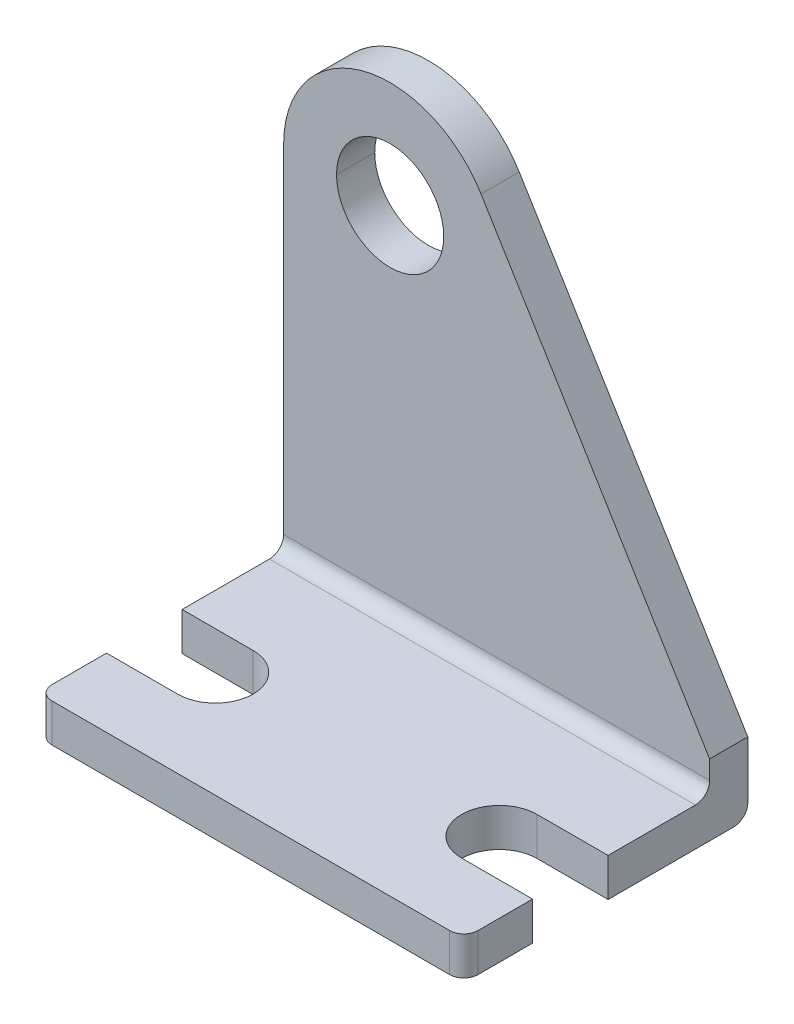
ISO-10303-21;
HEADER;
FILE_DESCRIPTION(('STEP AP214'),'2;1');
FILE_NAME('part.step','',(''),(''),'','','');
FILE_SCHEMA(('AUTOMOTIVE_DESIGN { 1 0 10303 214 1 1 1 1 }'));
ENDSEC;
DATA;
#1=APPLICATION_CONTEXT('core data for automotive mechanical design processes');
#2=APPLICATION_PROTOCOL_DEFINITION('international standard','automotive_design',2000,#1);
#3=PRODUCT_CONTEXT('',#1,'mechanical');
#4=PRODUCT('Part','Part','',(#3));
#5=PRODUCT_RELATED_PRODUCT_CATEGORY('part','',(#4));
#6=PRODUCT_DEFINITION_FORMATION('','',#4);
#7=PRODUCT_DEFINITION_CONTEXT('part definition',#1,'design');
#8=PRODUCT_DEFINITION('design','',#6,#7);
#9=PRODUCT_DEFINITION_SHAPE('','',#8);
#10=(LENGTH_UNIT() NAMED_UNIT(*) SI_UNIT(.MILLI.,.METRE.));
#11=(NAMED_UNIT(*) PLANE_ANGLE_UNIT() SI_UNIT($,.RADIAN.));
#12=(NAMED_UNIT(*) SI_UNIT($,.STERADIAN.) SOLID_ANGLE_UNIT());
#13=UNCERTAINTY_MEASURE_WITH_UNIT(LENGTH_MEASURE(1.E-05),#10,'distance_accuracy_value','');
#14=(GEOMETRIC_REPRESENTATION_CONTEXT(3) GLOBAL_UNCERTAINTY_ASSIGNED_CONTEXT((#13)) GLOBAL_UNIT_ASSIGNED_CONTEXT((#10,
#11,#12)) REPRESENTATION_CONTEXT('',''));
#15=CARTESIAN_POINT('',(0.,0.,0.));
#16=DIRECTION('',(0.,0.,1.));
#17=DIRECTION('',(1.,0.,0.));
#18=AXIS2_PLACEMENT_3D('',#15,#16,#17);
#19=CARTESIAN_POINT('',(36.8300000000003,3.4163,24.1300000000003));
#20=DIRECTION('',(0.,1.,0.));
#21=DIRECTION('',(-0.707106781186554,0.,-0.707106781186541));
#22=AXIS2_PLACEMENT_3D('',#19,#20,#21);
#23=CYLINDRICAL_SURFACE('',#22,1.27);
#24=CARTESIAN_POINT('',(36.8300000000003,0.,24.1300000000003));
#25=DIRECTION('',(0.,1.,0.));
#26=DIRECTION('',(1.,0.,0.));
#27=AXIS2_PLACEMENT_3D('',#24,#25,#26);
#28=CIRCLE('',#27,1.27);
#29=CARTESIAN_POINT('',(36.83,0.,25.4));
#30=VERTEX_POINT('',#29);
#31=CARTESIAN_POINT('',(38.1,0.,24.13));
#32=VERTEX_POINT('',#31);
#33=EDGE_CURVE('E11',#30,#32,#28,.T.);
#34=ORIENTED_EDGE('',*,*,#33,.T.);
#35=DIRECTION('',(0.,-1.,0.));
#36=VECTOR('',#35,1.);
#37=CARTESIAN_POINT('',(38.1,3.4163,24.13));
#38=LINE('',#37,#36);
#39=CARTESIAN_POINT('',(38.1,3.4163,24.13));
#40=VERTEX_POINT('',#39);
#41=EDGE_CURVE('E25',#40,#32,#38,.T.);
#42=ORIENTED_EDGE('',*,*,#41,.F.);
#43=CARTESIAN_POINT('',(36.8300000000003,3.4163,24.1300000000003));
#44=DIRECTION('',(0.,1.,0.));
#45=DIRECTION('',(1.,0.,0.));
#46=AXIS2_PLACEMENT_3D('',#43,#44,#45);
#47=CIRCLE('',#46,1.27);
#48=CARTESIAN_POINT('',(36.8300000000003,3.4163,25.4));
#49=VERTEX_POINT('',#48);
#50=EDGE_CURVE('E429',#49,#40,#47,.T.);
#51=ORIENTED_EDGE('',*,*,#50,.F.);
#52=DIRECTION('',(0.,-1.,0.));
#53=VECTOR('',#52,1.);
#54=CARTESIAN_POINT('',(36.83,3.4163,25.4));
#55=LINE('',#54,#53);
#56=EDGE_CURVE('E425',#49,#30,#55,.T.);
#57=ORIENTED_EDGE('',*,*,#56,.T.);
#58=EDGE_LOOP('',(#34,#42,#51,#57));
#59=FACE_BOUND('',#58,.T.);
#60=ADVANCED_FACE('F17',(#59),#23,.T.);
#61=CARTESIAN_POINT('',(38.1,3.4163,25.4));
#62=DIRECTION('',(0.,0.,-1.));
#63=DIRECTION('',(-1.,0.,0.));
#64=AXIS2_PLACEMENT_3D('',#61,#62,#63);
#65=PLANE('',#64);
#66=DIRECTION('',(0.,-1.,0.));
#67=VECTOR('',#66,1.);
#68=CARTESIAN_POINT('',(1.27000000000001,3.4163,25.4));
#69=LINE('',#68,#67);
#70=CARTESIAN_POINT('',(1.27000000000001,3.4163,25.4));
#71=VERTEX_POINT('',#70);
#72=CARTESIAN_POINT('',(1.26999999999986,0.,25.4));
#73=VERTEX_POINT('',#72);
#74=EDGE_CURVE('E421',#71,#73,#69,.T.);
#75=ORIENTED_EDGE('',*,*,#74,.T.);
#76=DIRECTION('',(-1.,0.,0.));
#77=VECTOR('',#76,1.);
#78=CARTESIAN_POINT('',(38.1,0.,25.4));
#79=LINE('',#78,#77);
#80=EDGE_CURVE('E416',#30,#73,#79,.T.);
#81=ORIENTED_EDGE('',*,*,#80,.F.);
#82=ORIENTED_EDGE('',*,*,#56,.F.);
#83=DIRECTION('',(-1.,0.,0.));
#84=VECTOR('',#83,1.);
#85=CARTESIAN_POINT('',(38.1,3.4163,25.4));
#86=LINE('',#85,#84);
#87=EDGE_CURVE('E412',#49,#71,#86,.T.);
#88=ORIENTED_EDGE('',*,*,#87,.T.);
#89=EDGE_LOOP('',(#75,#81,#82,#88));
#90=FACE_BOUND('',#89,.T.);
#91=ADVANCED_FACE('F447',(#90),#65,.F.);
#92=CARTESIAN_POINT('',(38.1,3.4163,4.6863));
#93=DIRECTION('',(0.,-1.,0.));
#94=DIRECTION('',(0.,0.,-1.));
#95=AXIS2_PLACEMENT_3D('',#92,#93,#94);
#96=PLANE('',#95);
#97=DIRECTION('',(0.,0.,1.));
#98=VECTOR('',#97,1.);
#99=CARTESIAN_POINT('',(0.,3.4163,4.6863));
#100=LINE('',#99,#98);
#101=CARTESIAN_POINT('',(0.,3.4163,19.2532));
#102=VERTEX_POINT('',#101);
#103=CARTESIAN_POINT('',(0.,3.4163,24.13));
#104=VERTEX_POINT('',#103);
#105=EDGE_CURVE('E408',#102,#104,#100,.T.);
#106=ORIENTED_EDGE('',*,*,#105,.T.);
#107=CARTESIAN_POINT('',(1.26999999999984,3.4163,24.1300000000001));
#108=DIRECTION('',(0.,1.,0.));
#109=DIRECTION('',(1.,0.,0.));
#110=AXIS2_PLACEMENT_3D('',#107,#108,#109);
#111=CIRCLE('',#110,1.27);
#112=EDGE_CURVE('E403',#104,#71,#111,.T.);
#113=ORIENTED_EDGE('',*,*,#112,.T.);
#114=ORIENTED_EDGE('',*,*,#87,.F.);
#115=ORIENTED_EDGE('',*,*,#50,.T.);
#116=DIRECTION('',(0.,0.,1.));
#117=VECTOR('',#116,1.);
#118=CARTESIAN_POINT('',(38.1,3.4163,4.6863));
#119=LINE('',#118,#117);
#120=CARTESIAN_POINT('',(38.1,3.4163,19.2532));
#121=VERTEX_POINT('',#120);
#122=EDGE_CURVE('E398',#121,#40,#119,.T.);
#123=ORIENTED_EDGE('',*,*,#122,.F.);
#124=DIRECTION('',(1.,0.,0.));
#125=VECTOR('',#124,1.);
#126=CARTESIAN_POINT('',(31.75,3.4163,19.2532));
#127=LINE('',#126,#125);
#128=CARTESIAN_POINT('',(31.75,3.4163,19.2532));
#129=VERTEX_POINT('',#128);
#130=EDGE_CURVE('E393',#129,#121,#127,.T.);
#131=ORIENTED_EDGE('',*,*,#130,.F.);
#132=CARTESIAN_POINT('',(31.75,3.4163,15.875));
#133=DIRECTION('',(0.,1.,0.));
#134=DIRECTION('',(1.,0.,0.));
#135=AXIS2_PLACEMENT_3D('',#132,#133,#134);
#136=CIRCLE('',#135,3.3782);
#137=CARTESIAN_POINT('',(31.75,3.4163,12.4968));
#138=VERTEX_POINT('',#137);
#139=EDGE_CURVE('E388',#138,#129,#136,.T.);
#140=ORIENTED_EDGE('',*,*,#139,.F.);
#141=DIRECTION('',(-1.,0.,0.));
#142=VECTOR('',#141,1.);
#143=CARTESIAN_POINT('',(38.1,3.4163,12.4968));
#144=LINE('',#143,#142);
#145=CARTESIAN_POINT('',(38.1,3.4163,12.4968));
#146=VERTEX_POINT('',#145);
#147=EDGE_CURVE('E383',#146,#138,#144,.T.);
#148=ORIENTED_EDGE('',*,*,#147,.F.);
#149=DIRECTION('',(0.,0.,1.));
#150=VECTOR('',#149,1.);
#151=CARTESIAN_POINT('',(38.1,3.4163,4.6863));
#152=LINE('',#151,#150);
#153=CARTESIAN_POINT('',(38.1,3.4163,4.6863));
#154=VERTEX_POINT('',#153);
#155=EDGE_CURVE('E378',#154,#146,#152,.T.);
#156=ORIENTED_EDGE('',*,*,#155,.F.);
#157=DIRECTION('',(-1.,0.,0.));
#158=VECTOR('',#157,1.);
#159=CARTESIAN_POINT('',(38.1,3.4163,4.6863));
#160=LINE('',#159,#158);
#161=CARTESIAN_POINT('',(0.,3.4163,4.6863));
#162=VERTEX_POINT('',#161);
#163=EDGE_CURVE('E374',#154,#162,#160,.T.);
#164=ORIENTED_EDGE('',*,*,#163,.T.);
#165=DIRECTION('',(0.,0.,1.));
#166=VECTOR('',#165,1.);
#167=CARTESIAN_POINT('',(0.,3.4163,4.6863));
#168=LINE('',#167,#166);
#169=CARTESIAN_POINT('',(0.,3.4163,12.4968));
#170=VERTEX_POINT('',#169);
#171=EDGE_CURVE('E370',#162,#170,#168,.T.);
#172=ORIENTED_EDGE('',*,*,#171,.T.);
#173=DIRECTION('',(-1.,0.,0.));
#174=VECTOR('',#173,1.);
#175=CARTESIAN_POINT('',(6.35,3.4163,12.4968));
#176=LINE('',#175,#174);
#177=CARTESIAN_POINT('',(6.35,3.4163,12.4968));
#178=VERTEX_POINT('',#177);
#179=EDGE_CURVE('E365',#178,#170,#176,.T.);
#180=ORIENTED_EDGE('',*,*,#179,.F.);
#181=CARTESIAN_POINT('',(6.35,3.4163,15.875));
#182=DIRECTION('',(0.,1.,0.));
#183=DIRECTION('',(1.,0.,0.));
#184=AXIS2_PLACEMENT_3D('',#181,#182,#183);
#185=CIRCLE('',#184,3.3782);
#186=CARTESIAN_POINT('',(6.35,3.4163,19.2532));
#187=VERTEX_POINT('',#186);
#188=EDGE_CURVE('E360',#187,#178,#185,.T.);
#189=ORIENTED_EDGE('',*,*,#188,.F.);
#190=DIRECTION('',(1.,0.,0.));
#191=VECTOR('',#190,1.);
#192=CARTESIAN_POINT('',(0.,3.4163,19.2532));
#193=LINE('',#192,#191);
#194=EDGE_CURVE('E355',#102,#187,#193,.T.);
#195=ORIENTED_EDGE('',*,*,#194,.F.);
#196=EDGE_LOOP('',(#106,#113,#114,#115,#123,#131,#140,#148,#156,#164,#172,#180,#189,#195));
#197=FACE_BOUND('',#196,.T.);
#198=ADVANCED_FACE('F441',(#197),#96,.F.);
#199=CARTESIAN_POINT('',(0.,3.4163,19.2532));
#200=DIRECTION('',(0.,0.,-1.));
#201=DIRECTION('',(-1.,0.,0.));
#202=AXIS2_PLACEMENT_3D('',#199,#200,#201);
#203=PLANE('',#202);
#204=DIRECTION('',(1.,0.,0.));
#205=VECTOR('',#204,1.);
#206=CARTESIAN_POINT('',(0.,0.,19.2532));
#207=LINE('',#206,#205);
#208=CARTESIAN_POINT('',(0.,0.,19.2532));
#209=VERTEX_POINT('',#208);
#210=CARTESIAN_POINT('',(6.35,0.,19.2532));
#211=VERTEX_POINT('',#210);
#212=EDGE_CURVE('E350',#209,#211,#207,.T.);
#213=ORIENTED_EDGE('',*,*,#212,.F.);
#214=DIRECTION('',(0.,-1.,0.));
#215=VECTOR('',#214,1.);
#216=CARTESIAN_POINT('',(0.,3.4163,19.2532));
#217=LINE('',#216,#215);
#218=EDGE_CURVE('E345',#102,#209,#217,.T.);
#219=ORIENTED_EDGE('',*,*,#218,.F.);
#220=ORIENTED_EDGE('',*,*,#194,.T.);
#221=DIRECTION('',(0.,-1.,0.));
#222=VECTOR('',#221,1.);
#223=CARTESIAN_POINT('',(6.35,3.4163,19.2532));
#224=LINE('',#223,#222);
#225=EDGE_CURVE('E341',#187,#211,#224,.T.);
#226=ORIENTED_EDGE('',*,*,#225,.T.);
#227=EDGE_LOOP('',(#213,#219,#220,#226));
#228=FACE_BOUND('',#227,.T.);
#229=ADVANCED_FACE('F488',(#228),#203,.T.);
#230=CARTESIAN_POINT('',(6.35,3.4163,15.875));
#231=DIRECTION('',(0.,1.,0.));
#232=DIRECTION('',(-1.,0.,0.));
#233=AXIS2_PLACEMENT_3D('',#230,#231,#232);
#234=CYLINDRICAL_SURFACE('',#233,3.3782);
#235=DIRECTION('',(0.,-1.,0.));
#236=VECTOR('',#235,1.);
#237=CARTESIAN_POINT('',(6.35,3.4163,12.4968));
#238=LINE('',#237,#236);
#239=CARTESIAN_POINT('',(6.35,0.,12.4968));
#240=VERTEX_POINT('',#239);
#241=EDGE_CURVE('E337',#178,#240,#238,.T.);
#242=ORIENTED_EDGE('',*,*,#241,.T.);
#243=CARTESIAN_POINT('',(6.35,0.,15.875));
#244=DIRECTION('',(0.,1.,0.));
#245=DIRECTION('',(1.,0.,0.));
#246=AXIS2_PLACEMENT_3D('',#243,#244,#245);
#247=CIRCLE('',#246,3.3782);
#248=EDGE_CURVE('E332',#211,#240,#247,.T.);
#249=ORIENTED_EDGE('',*,*,#248,.F.);
#250=ORIENTED_EDGE('',*,*,#225,.F.);
#251=ORIENTED_EDGE('',*,*,#188,.T.);
#252=EDGE_LOOP('',(#242,#249,#250,#251));
#253=FACE_BOUND('',#252,.T.);
#254=ADVANCED_FACE('F483',(#253),#234,.F.);
#255=CARTESIAN_POINT('',(38.1,0.,25.4));
#256=DIRECTION('',(0.,1.,0.));
#257=DIRECTION('',(0.,0.,1.));
#258=AXIS2_PLACEMENT_3D('',#255,#256,#257);
#259=PLANE('',#258);
#260=ORIENTED_EDGE('',*,*,#80,.T.);
#261=CARTESIAN_POINT('',(1.26999999999984,0.,24.1300000000001));
#262=DIRECTION('',(0.,1.,0.));
#263=DIRECTION('',(1.,0.,0.));
#264=AXIS2_PLACEMENT_3D('',#261,#262,#263);
#265=CIRCLE('',#264,1.27);
#266=CARTESIAN_POINT('',(0.,0.,24.13));
#267=VERTEX_POINT('',#266);
#268=EDGE_CURVE('E327',#267,#73,#265,.T.);
#269=ORIENTED_EDGE('',*,*,#268,.F.);
#270=DIRECTION('',(0.,0.,-1.));
#271=VECTOR('',#270,1.);
#272=CARTESIAN_POINT('',(0.,0.,25.4));
#273=LINE('',#272,#271);
#274=EDGE_CURVE('E322',#267,#209,#273,.T.);
#275=ORIENTED_EDGE('',*,*,#274,.T.);
#276=ORIENTED_EDGE('',*,*,#212,.T.);
#277=ORIENTED_EDGE('',*,*,#248,.T.);
#278=DIRECTION('',(-1.,0.,0.));
#279=VECTOR('',#278,1.);
#280=CARTESIAN_POINT('',(6.35,0.,12.4968));
#281=LINE('',#280,#279);
#282=CARTESIAN_POINT('',(0.,0.,12.4968));
#283=VERTEX_POINT('',#282);
#284=EDGE_CURVE('E318',#240,#283,#281,.T.);
#285=ORIENTED_EDGE('',*,*,#284,.T.);
#286=DIRECTION('',(0.,0.,-1.));
#287=VECTOR('',#286,1.);
#288=CARTESIAN_POINT('',(0.,0.,25.4));
#289=LINE('',#288,#287);
#290=CARTESIAN_POINT('',(0.,0.,1.27));
#291=VERTEX_POINT('',#290);
#292=EDGE_CURVE('E314',#283,#291,#289,.T.);
#293=ORIENTED_EDGE('',*,*,#292,.T.);
#294=DIRECTION('',(-1.,0.,0.));
#295=VECTOR('',#294,1.);
#296=CARTESIAN_POINT('',(38.1,0.,1.27));
#297=LINE('',#296,#295);
#298=CARTESIAN_POINT('',(38.1,0.,1.27));
#299=VERTEX_POINT('',#298);
#300=EDGE_CURVE('E309',#299,#291,#297,.T.);
#301=ORIENTED_EDGE('',*,*,#300,.F.);
#302=DIRECTION('',(0.,0.,-1.));
#303=VECTOR('',#302,1.);
#304=CARTESIAN_POINT('',(38.1,0.,25.4));
#305=LINE('',#304,#303);
#306=CARTESIAN_POINT('',(38.1,0.,12.4968));
#307=VERTEX_POINT('',#306);
#308=EDGE_CURVE('E304',#307,#299,#305,.T.);
#309=ORIENTED_EDGE('',*,*,#308,.F.);
#310=DIRECTION('',(-1.,0.,0.));
#311=VECTOR('',#310,1.);
#312=CARTESIAN_POINT('',(38.1,0.,12.4968));
#313=LINE('',#312,#311);
#314=CARTESIAN_POINT('',(31.75,0.,12.4968));
#315=VERTEX_POINT('',#314);
#316=EDGE_CURVE('E300',#307,#315,#313,.T.);
#317=ORIENTED_EDGE('',*,*,#316,.T.);
#318=CARTESIAN_POINT('',(31.75,0.,15.875));
#319=DIRECTION('',(0.,1.,0.));
#320=DIRECTION('',(1.,0.,0.));
#321=AXIS2_PLACEMENT_3D('',#318,#319,#320);
#322=CIRCLE('',#321,3.3782);
#323=CARTESIAN_POINT('',(31.75,0.,19.2532));
#324=VERTEX_POINT('',#323);
#325=EDGE_CURVE('E296',#315,#324,#322,.T.);
#326=ORIENTED_EDGE('',*,*,#325,.T.);
#327=DIRECTION('',(1.,0.,0.));
#328=VECTOR('',#327,1.);
#329=CARTESIAN_POINT('',(31.75,0.,19.2532));
#330=LINE('',#329,#328);
#331=CARTESIAN_POINT('',(38.1,0.,19.2532));
#332=VERTEX_POINT('',#331);
#333=EDGE_CURVE('E292',#324,#332,#330,.T.);
#334=ORIENTED_EDGE('',*,*,#333,.T.);
#335=DIRECTION('',(0.,0.,-1.));
#336=VECTOR('',#335,1.);
#337=CARTESIAN_POINT('',(38.1,0.,25.4));
#338=LINE('',#337,#336);
#339=EDGE_CURVE('E287',#32,#332,#338,.T.);
#340=ORIENTED_EDGE('',*,*,#339,.F.);
#341=ORIENTED_EDGE('',*,*,#33,.F.);
#342=EDGE_LOOP('',(#260,#269,#275,#276,#277,#285,#293,#301,#309,#317,#326,#334,#340,#341));
#343=FACE_BOUND('',#342,.T.);
#344=ADVANCED_FACE('F450',(#343),#259,.F.);
#345=CARTESIAN_POINT('',(38.1,1.26999999999998,1.26999999999998));
#346=DIRECTION('',(1.,0.,0.));
#347=DIRECTION('',(0.,0.,-1.));
#348=AXIS2_PLACEMENT_3D('',#345,#346,#347);
#349=PLANE('',#348);
#350=ORIENTED_EDGE('',*,*,#41,.T.);
#351=ORIENTED_EDGE('',*,*,#339,.T.);
#352=DIRECTION('',(0.,-1.,0.));
#353=VECTOR('',#352,1.);
#354=CARTESIAN_POINT('',(38.1,3.4163,19.2532));
#355=LINE('',#354,#353);
#356=EDGE_CURVE('E282',#121,#332,#355,.T.);
#357=ORIENTED_EDGE('',*,*,#356,.F.);
#358=ORIENTED_EDGE('',*,*,#122,.T.);
#359=EDGE_LOOP('',(#350,#351,#357,#358));
#360=FACE_BOUND('',#359,.T.);
#361=ADVANCED_FACE('F438',(#360),#349,.T.);
#362=CARTESIAN_POINT('',(31.75,3.4163,19.2532));
#363=DIRECTION('',(0.,0.,-1.));
#364=DIRECTION('',(-1.,0.,0.));
#365=AXIS2_PLACEMENT_3D('',#362,#363,#364);
#366=PLANE('',#365);
#367=ORIENTED_EDGE('',*,*,#333,.F.);
#368=DIRECTION('',(0.,-1.,0.));
#369=VECTOR('',#368,1.);
#370=CARTESIAN_POINT('',(31.75,3.4163,19.2532));
#371=LINE('',#370,#369);
#372=EDGE_CURVE('E277',#129,#324,#371,.T.);
#373=ORIENTED_EDGE('',*,*,#372,.F.);
#374=ORIENTED_EDGE('',*,*,#130,.T.);
#375=ORIENTED_EDGE('',*,*,#356,.T.);
#376=EDGE_LOOP('',(#367,#373,#374,#375));
#377=FACE_BOUND('',#376,.T.);
#378=ADVANCED_FACE('F454',(#377),#366,.T.);
#379=CARTESIAN_POINT('',(31.75,3.4163,15.875));
#380=DIRECTION('',(0.,1.,0.));
#381=DIRECTION('',(1.,0.,0.));
#382=AXIS2_PLACEMENT_3D('',#379,#380,#381);
#383=CYLINDRICAL_SURFACE('',#382,3.3782);
#384=DIRECTION('',(0.,-1.,0.));
#385=VECTOR('',#384,1.);
#386=CARTESIAN_POINT('',(31.75,3.4163,12.4968));
#387=LINE('',#386,#385);
#388=EDGE_CURVE('E272',#138,#315,#387,.T.);
#389=ORIENTED_EDGE('',*,*,#388,.F.);
#390=ORIENTED_EDGE('',*,*,#139,.T.);
#391=ORIENTED_EDGE('',*,*,#372,.T.);
#392=ORIENTED_EDGE('',*,*,#325,.F.);
#393=EDGE_LOOP('',(#389,#390,#391,#392));
#394=FACE_BOUND('',#393,.T.);
#395=ADVANCED_FACE('F457',(#394),#383,.F.);
#396=CARTESIAN_POINT('',(38.1,3.4163,12.4968));
#397=DIRECTION('',(0.,0.,1.));
#398=DIRECTION('',(1.,0.,0.));
#399=AXIS2_PLACEMENT_3D('',#396,#397,#398);
#400=PLANE('',#399);
#401=ORIENTED_EDGE('',*,*,#316,.F.);
#402=DIRECTION('',(0.,-1.,0.));
#403=VECTOR('',#402,1.);
#404=CARTESIAN_POINT('',(38.1,3.4163,12.4968));
#405=LINE('',#404,#403);
#406=EDGE_CURVE('E267',#146,#307,#405,.T.);
#407=ORIENTED_EDGE('',*,*,#406,.F.);
#408=ORIENTED_EDGE('',*,*,#147,.T.);
#409=ORIENTED_EDGE('',*,*,#388,.T.);
#410=EDGE_LOOP('',(#401,#407,#408,#409));
#411=FACE_BOUND('',#410,.T.);
#412=ADVANCED_FACE('F462',(#411),#400,.T.);
#413=CARTESIAN_POINT('',(38.1,1.26999999999998,1.26999999999998));
#414=DIRECTION('',(1.,0.,0.));
#415=DIRECTION('',(0.,0.,-1.));
#416=AXIS2_PLACEMENT_3D('',#413,#414,#415);
#417=PLANE('',#416);
#418=ORIENTED_EDGE('',*,*,#155,.T.);
#419=ORIENTED_EDGE('',*,*,#406,.T.);
#420=ORIENTED_EDGE('',*,*,#308,.T.);
#421=CARTESIAN_POINT('',(38.1,1.26999999999998,1.26999999999998));
#422=DIRECTION('',(1.,0.,0.));
#423=DIRECTION('',(0.,0.,-1.));
#424=AXIS2_PLACEMENT_3D('',#421,#422,#423);
#425=CIRCLE('',#424,1.27);
#426=CARTESIAN_POINT('',(38.1,1.27,0.));
#427=VERTEX_POINT('',#426);
#428=EDGE_CURVE('E263',#299,#427,#425,.T.);
#429=ORIENTED_EDGE('',*,*,#428,.T.);
#430=DIRECTION('',(0.,1.,0.));
#431=VECTOR('',#430,1.);
#432=CARTESIAN_POINT('',(38.1,1.27,0.));
#433=LINE('',#432,#431);
#434=CARTESIAN_POINT('',(38.1,6.35,0.));
#435=VERTEX_POINT('',#434);
#436=EDGE_CURVE('E259',#427,#435,#433,.T.);
#437=ORIENTED_EDGE('',*,*,#436,.T.);
#438=DIRECTION('',(0.,0.,-1.));
#439=VECTOR('',#438,1.);
#440=CARTESIAN_POINT('',(38.1,6.35,1.26999999999998));
#441=LINE('',#440,#439);
#442=CARTESIAN_POINT('',(38.1,6.35,3.4163));
#443=VERTEX_POINT('',#442);
#444=EDGE_CURVE('E254',#443,#435,#441,.T.);
#445=ORIENTED_EDGE('',*,*,#444,.F.);
#446=DIRECTION('',(0.,-1.,0.));
#447=VECTOR('',#446,1.);
#448=CARTESIAN_POINT('',(38.1,44.45,3.4163));
#449=LINE('',#448,#447);
#450=CARTESIAN_POINT('',(38.1,4.6863,3.4163));
#451=VERTEX_POINT('',#450);
#452=EDGE_CURVE('E250',#443,#451,#449,.T.);
#453=ORIENTED_EDGE('',*,*,#452,.T.);
#454=CARTESIAN_POINT('',(38.1,4.68630000000005,4.68630000000005));
#455=DIRECTION('',(1.,0.,0.));
#456=DIRECTION('',(0.,0.,-1.));
#457=AXIS2_PLACEMENT_3D('',#454,#455,#456);
#458=CIRCLE('',#457,1.27);
#459=EDGE_CURVE('E245',#154,#451,#458,.T.);
#460=ORIENTED_EDGE('',*,*,#459,.F.);
#461=EDGE_LOOP('',(#418,#419,#420,#429,#437,#445,#453,#460));
#462=FACE_BOUND('',#461,.T.);
#463=ADVANCED_FACE('F464',(#462),#417,.T.);
#464=CARTESIAN_POINT('',(38.1,4.68630000000005,4.68630000000005));
#465=DIRECTION('',(1.,0.,0.));
#466=DIRECTION('',(0.,0.707106781186533,0.707106781186562));
#467=AXIS2_PLACEMENT_3D('',#464,#465,#466);
#468=CYLINDRICAL_SURFACE('',#467,1.27);
#469=DIRECTION('',(-1.,0.,0.));
#470=VECTOR('',#469,1.);
#471=CARTESIAN_POINT('',(38.1,4.6863,3.4163));
#472=LINE('',#471,#470);
#473=CARTESIAN_POINT('',(0.,4.6863,3.4163));
#474=VERTEX_POINT('',#473);
#475=EDGE_CURVE('E241',#451,#474,#472,.T.);
#476=ORIENTED_EDGE('',*,*,#475,.T.);
#477=CARTESIAN_POINT('',(0.,4.68630000000005,4.68630000000005));
#478=DIRECTION('',(1.,0.,0.));
#479=DIRECTION('',(0.,0.,-1.));
#480=AXIS2_PLACEMENT_3D('',#477,#478,#479);
#481=CIRCLE('',#480,1.27);
#482=EDGE_CURVE('E236',#162,#474,#481,.T.);
#483=ORIENTED_EDGE('',*,*,#482,.F.);
#484=ORIENTED_EDGE('',*,*,#163,.F.);
#485=ORIENTED_EDGE('',*,*,#459,.T.);
#486=EDGE_LOOP('',(#476,#483,#484,#485));
#487=FACE_BOUND('',#486,.T.);
#488=ADVANCED_FACE('F470',(#487),#468,.F.);
#489=CARTESIAN_POINT('',(0.,1.26999999999998,1.26999999999998));
#490=DIRECTION('',(1.,0.,0.));
#491=DIRECTION('',(0.,0.,-1.));
#492=AXIS2_PLACEMENT_3D('',#489,#490,#491);
#493=PLANE('',#492);
#494=DIRECTION('',(0.,-1.,0.));
#495=VECTOR('',#494,1.);
#496=CARTESIAN_POINT('',(0.,3.4163,12.4968));
#497=LINE('',#496,#495);
#498=EDGE_CURVE('E231',#170,#283,#497,.T.);
#499=ORIENTED_EDGE('',*,*,#498,.F.);
#500=ORIENTED_EDGE('',*,*,#171,.F.);
#501=ORIENTED_EDGE('',*,*,#482,.T.);
#502=DIRECTION('',(0.,-1.,0.));
#503=VECTOR('',#502,1.);
#504=CARTESIAN_POINT('',(0.,44.45,3.4163));
#505=LINE('',#504,#503);
#506=CARTESIAN_POINT('',(0.,34.925,3.4163));
#507=VERTEX_POINT('',#506);
#508=EDGE_CURVE('E226',#507,#474,#505,.T.);
#509=ORIENTED_EDGE('',*,*,#508,.F.);
#510=DIRECTION('',(0.,0.,-1.));
#511=VECTOR('',#510,1.);
#512=CARTESIAN_POINT('',(0.,34.9250000000003,25.4));
#513=LINE('',#512,#511);
#514=CARTESIAN_POINT('',(0.,34.9250000000003,0.));
#515=VERTEX_POINT('',#514);
#516=EDGE_CURVE('E222',#507,#515,#513,.T.);
#517=ORIENTED_EDGE('',*,*,#516,.T.);
#518=DIRECTION('',(0.,1.,0.));
#519=VECTOR('',#518,1.);
#520=CARTESIAN_POINT('',(0.,1.27,0.));
#521=LINE('',#520,#519);
#522=CARTESIAN_POINT('',(0.,1.27,0.));
#523=VERTEX_POINT('',#522);
#524=EDGE_CURVE('E217',#523,#515,#521,.T.);
#525=ORIENTED_EDGE('',*,*,#524,.F.);
#526=CARTESIAN_POINT('',(0.,1.26999999999998,1.26999999999998));
#527=DIRECTION('',(1.,0.,0.));
#528=DIRECTION('',(0.,0.,-1.));
#529=AXIS2_PLACEMENT_3D('',#526,#527,#528);
#530=CIRCLE('',#529,1.27);
#531=EDGE_CURVE('E212',#291,#523,#530,.T.);
#532=ORIENTED_EDGE('',*,*,#531,.F.);
#533=ORIENTED_EDGE('',*,*,#292,.F.);
#534=EDGE_LOOP('',(#499,#500,#501,#509,#517,#525,#532,#533));
#535=FACE_BOUND('',#534,.T.);
#536=ADVANCED_FACE('F475',(#535),#493,.F.);
#537=CARTESIAN_POINT('',(38.1,1.26999999999998,1.26999999999998));
#538=DIRECTION('',(1.,0.,0.));
#539=DIRECTION('',(0.,0.707106781186548,0.707106781186547));
#540=AXIS2_PLACEMENT_3D('',#537,#538,#539);
#541=CYLINDRICAL_SURFACE('',#540,1.27);
#542=ORIENTED_EDGE('',*,*,#531,.T.);
#543=DIRECTION('',(-1.,0.,0.));
#544=VECTOR('',#543,1.);
#545=CARTESIAN_POINT('',(38.1,1.27,0.));
#546=LINE('',#545,#544);
#547=EDGE_CURVE('E207',#427,#523,#546,.T.);
#548=ORIENTED_EDGE('',*,*,#547,.F.);
#549=ORIENTED_EDGE('',*,*,#428,.F.);
#550=ORIENTED_EDGE('',*,*,#300,.T.);
#551=EDGE_LOOP('',(#542,#548,#549,#550));
#552=FACE_BOUND('',#551,.T.);
#553=ADVANCED_FACE('F535',(#552),#541,.T.);
#554=CARTESIAN_POINT('',(38.1,1.27,0.));
#555=DIRECTION('',(0.,0.,1.));
#556=DIRECTION('',(1.,0.,0.));
#557=AXIS2_PLACEMENT_3D('',#554,#555,#556);
#558=PLANE('',#557);
#559=CARTESIAN_POINT('',(9.525,34.925,0.));
#560=DIRECTION('',(0.,0.,1.));
#561=DIRECTION('',(1.,0.,0.));
#562=AXIS2_PLACEMENT_3D('',#559,#560,#561);
#563=CIRCLE('',#562,4.79425);
#564=CARTESIAN_POINT('',(14.31925,34.925,0.));
#565=VERTEX_POINT('',#564);
#566=CARTESIAN_POINT('',(4.73075,34.925,0.));
#567=VERTEX_POINT('',#566);
#568=EDGE_CURVE('E203',#565,#567,#563,.T.);
#569=ORIENTED_EDGE('',*,*,#568,.T.);
#570=CARTESIAN_POINT('',(9.525,34.925,0.));
#571=DIRECTION('',(0.,0.,1.));
#572=DIRECTION('',(1.,0.,0.));
#573=AXIS2_PLACEMENT_3D('',#570,#571,#572);
#574=CIRCLE('',#573,4.79425);
#575=EDGE_CURVE('E170',#567,#565,#574,.T.);
#576=ORIENTED_EDGE('',*,*,#575,.T.);
#577=EDGE_LOOP('',(#569,#576));
#578=FACE_BOUND('',#577,.T.);
#579=ORIENTED_EDGE('',*,*,#524,.T.);
#580=CARTESIAN_POINT('',(9.52499999999992,34.9250000000003,0.));
#581=DIRECTION('',(0.,0.,1.));
#582=DIRECTION('',(1.,0.,0.));
#583=AXIS2_PLACEMENT_3D('',#580,#581,#582);
#584=CIRCLE('',#583,9.525);
#585=CARTESIAN_POINT('',(17.657930180668,39.8829301806679,0.));
#586=VERTEX_POINT('',#585);
#587=EDGE_CURVE('E195',#586,#515,#584,.T.);
#588=ORIENTED_EDGE('',*,*,#587,.F.);
#589=DIRECTION('',(-0.520517604269611,0.853850937602943,0.));
#590=VECTOR('',#589,1.);
#591=CARTESIAN_POINT('',(38.1,6.35,0.));
#592=LINE('',#591,#590);
#593=EDGE_CURVE('E190',#435,#586,#592,.T.);
#594=ORIENTED_EDGE('',*,*,#593,.F.);
#595=ORIENTED_EDGE('',*,*,#436,.F.);
#596=ORIENTED_EDGE('',*,*,#547,.T.);
#597=EDGE_LOOP('',(#579,#588,#594,#595,#596));
#598=FACE_BOUND('',#597,.T.);
#599=ADVANCED_FACE('F538',(#578,#598),#558,.F.);
#600=CARTESIAN_POINT('',(38.1,6.35,25.4));
#601=DIRECTION('',(-0.853850937602943,-0.520517604269611,0.));
#602=DIRECTION('',(0.520517604269611,-0.853850937602943,0.));
#603=AXIS2_PLACEMENT_3D('',#600,#601,#602);
#604=PLANE('',#603);
#605=ORIENTED_EDGE('',*,*,#444,.T.);
#606=ORIENTED_EDGE('',*,*,#593,.T.);
#607=DIRECTION('',(0.,0.,-1.));
#608=VECTOR('',#607,1.);
#609=CARTESIAN_POINT('',(17.657930180668,39.8829301806679,25.4));
#610=LINE('',#609,#608);
#611=CARTESIAN_POINT('',(17.657930180668,39.8829301806679,3.4163));
#612=VERTEX_POINT('',#611);
#613=EDGE_CURVE('E179',#612,#586,#610,.T.);
#614=ORIENTED_EDGE('',*,*,#613,.F.);
#615=DIRECTION('',(-0.520517604269611,0.853850937602943,0.));
#616=VECTOR('',#615,1.);
#617=CARTESIAN_POINT('',(21.1666666666666,34.1272402408907,3.4163));
#618=LINE('',#617,#616);
#619=EDGE_CURVE('E176',#443,#612,#618,.T.);
#620=ORIENTED_EDGE('',*,*,#619,.F.);
#621=EDGE_LOOP('',(#605,#606,#614,#620));
#622=FACE_BOUND('',#621,.T.);
#623=ADVANCED_FACE('F542',(#622),#604,.F.);
#624=CARTESIAN_POINT('',(38.1,44.45,3.4163));
#625=DIRECTION('',(0.,0.,-1.));
#626=DIRECTION('',(-1.,0.,0.));
#627=AXIS2_PLACEMENT_3D('',#624,#625,#626);
#628=PLANE('',#627);
#629=CARTESIAN_POINT('',(9.525,34.925,3.4163));
#630=DIRECTION('',(0.,0.,1.));
#631=DIRECTION('',(1.,0.,0.));
#632=AXIS2_PLACEMENT_3D('',#629,#630,#631);
#633=CIRCLE('',#632,4.79425);
#634=CARTESIAN_POINT('',(14.31925,34.925,3.4163));
#635=VERTEX_POINT('',#634);
#636=CARTESIAN_POINT('',(4.73075,34.925,3.4163));
#637=VERTEX_POINT('',#636);
#638=EDGE_CURVE('E160',#635,#637,#633,.T.);
#639=ORIENTED_EDGE('',*,*,#638,.F.);
#640=CARTESIAN_POINT('',(9.525,34.925,3.4163));
#641=DIRECTION('',(0.,0.,1.));
#642=DIRECTION('',(1.,0.,0.));
#643=AXIS2_PLACEMENT_3D('',#640,#641,#642);
#644=CIRCLE('',#643,4.79425);
#645=EDGE_CURVE('E155',#637,#635,#644,.T.);
#646=ORIENTED_EDGE('',*,*,#645,.F.);
#647=EDGE_LOOP('',(#639,#646));
#648=FACE_BOUND('',#647,.T.);
#649=ORIENTED_EDGE('',*,*,#619,.T.);
#650=CARTESIAN_POINT('',(9.52499999999992,34.9250000000003,3.4163));
#651=DIRECTION('',(0.,0.,-1.));
#652=DIRECTION('',(-1.,0.,0.));
#653=AXIS2_PLACEMENT_3D('',#650,#651,#652);
#654=CIRCLE('',#653,9.525);
#655=EDGE_CURVE('E164',#507,#612,#654,.T.);
#656=ORIENTED_EDGE('',*,*,#655,.F.);
#657=ORIENTED_EDGE('',*,*,#508,.T.);
#658=ORIENTED_EDGE('',*,*,#475,.F.);
#659=ORIENTED_EDGE('',*,*,#452,.F.);
#660=EDGE_LOOP('',(#649,#656,#657,#658,#659));
#661=FACE_BOUND('',#660,.T.);
#662=ADVANCED_FACE('F157',(#648,#661),#628,.F.);
#663=CARTESIAN_POINT('',(9.52499999999992,34.9250000000003,25.4));
#664=DIRECTION('',(0.,0.,1.));
#665=DIRECTION('',(0.270323012706132,-0.962769686270543,0.));
#666=AXIS2_PLACEMENT_3D('',#663,#664,#665);
#667=CYLINDRICAL_SURFACE('',#666,9.525);
#668=ORIENTED_EDGE('',*,*,#587,.T.);
#669=ORIENTED_EDGE('',*,*,#516,.F.);
#670=ORIENTED_EDGE('',*,*,#655,.T.);
#671=ORIENTED_EDGE('',*,*,#613,.T.);
#672=EDGE_LOOP('',(#668,#669,#670,#671));
#673=FACE_BOUND('',#672,.T.);
#674=ADVANCED_FACE('F549',(#673),#667,.T.);
#675=CARTESIAN_POINT('',(9.525,34.925,3.4163));
#676=DIRECTION('',(0.,0.,1.));
#677=DIRECTION('',(0.,1.,0.));
#678=AXIS2_PLACEMENT_3D('',#675,#676,#677);
#679=CYLINDRICAL_SURFACE('',#678,4.79425);
#680=ORIENTED_EDGE('',*,*,#575,.F.);
#681=DIRECTION('',(0.,0.,1.));
#682=VECTOR('',#681,1.);
#683=CARTESIAN_POINT('',(4.73075,34.925,0.));
#684=LINE('',#683,#682);
#685=EDGE_CURVE('E168',#567,#637,#684,.T.);
#686=ORIENTED_EDGE('',*,*,#685,.T.);
#687=ORIENTED_EDGE('',*,*,#645,.T.);
#688=DIRECTION('',(0.,0.,1.));
#689=VECTOR('',#688,1.);
#690=CARTESIAN_POINT('',(14.31925,34.925,0.));
#691=LINE('',#690,#689);
#692=EDGE_CURVE('E173',#565,#635,#691,.T.);
#693=ORIENTED_EDGE('',*,*,#692,.F.);
#694=EDGE_LOOP('',(#680,#686,#687,#693));
#695=FACE_BOUND('',#694,.T.);
#696=ADVANCED_FACE('F169',(#695),#679,.F.);
#697=CARTESIAN_POINT('',(9.525,34.925,3.4163));
#698=DIRECTION('',(0.,0.,1.));
#699=DIRECTION('',(0.,-1.,0.));
#700=AXIS2_PLACEMENT_3D('',#697,#698,#699);
#701=CYLINDRICAL_SURFACE('',#700,4.79425);
#702=ORIENTED_EDGE('',*,*,#638,.T.);
#703=ORIENTED_EDGE('',*,*,#685,.F.);
#704=ORIENTED_EDGE('',*,*,#568,.F.);
#705=ORIENTED_EDGE('',*,*,#692,.T.);
#706=EDGE_LOOP('',(#702,#703,#704,#705));
#707=FACE_BOUND('',#706,.T.);
#708=ADVANCED_FACE('F175',(#707),#701,.F.);
#709=CARTESIAN_POINT('',(6.35,3.4163,12.4968));
#710=DIRECTION('',(0.,0.,1.));
#711=DIRECTION('',(1.,0.,0.));
#712=AXIS2_PLACEMENT_3D('',#709,#710,#711);
#713=PLANE('',#712);
#714=ORIENTED_EDGE('',*,*,#284,.F.);
#715=ORIENTED_EDGE('',*,*,#241,.F.);
#716=ORIENTED_EDGE('',*,*,#179,.T.);
#717=ORIENTED_EDGE('',*,*,#498,.T.);
#718=EDGE_LOOP('',(#714,#715,#716,#717));
#719=FACE_BOUND('',#718,.T.);
#720=ADVANCED_FACE('F480',(#719),#713,.T.);
#721=CARTESIAN_POINT('',(0.,1.26999999999998,1.26999999999998));
#722=DIRECTION('',(1.,0.,0.));
#723=DIRECTION('',(0.,0.,-1.));
#724=AXIS2_PLACEMENT_3D('',#721,#722,#723);
#725=PLANE('',#724);
#726=ORIENTED_EDGE('',*,*,#274,.F.);
#727=DIRECTION('',(0.,-1.,0.));
#728=VECTOR('',#727,1.);
#729=CARTESIAN_POINT('',(0.,3.4163,24.13));
#730=LINE('',#729,#728);
#731=EDGE_CURVE('E494',#104,#267,#730,.T.);
#732=ORIENTED_EDGE('',*,*,#731,.F.);
#733=ORIENTED_EDGE('',*,*,#105,.F.);
#734=ORIENTED_EDGE('',*,*,#218,.T.);
#735=EDGE_LOOP('',(#726,#732,#733,#734));
#736=FACE_BOUND('',#735,.T.);
#737=ADVANCED_FACE('F495',(#736),#725,.F.);
#738=CARTESIAN_POINT('',(1.26999999999984,3.4163,24.1300000000001));
#739=DIRECTION('',(0.,1.,0.));
#740=DIRECTION('',(0.707106781186543,0.,-0.707106781186552));
#741=AXIS2_PLACEMENT_3D('',#738,#739,#740);
#742=CYLINDRICAL_SURFACE('',#741,1.27);
#743=ORIENTED_EDGE('',*,*,#268,.T.);
#744=ORIENTED_EDGE('',*,*,#74,.F.);
#745=ORIENTED_EDGE('',*,*,#112,.F.);
#746=ORIENTED_EDGE('',*,*,#731,.T.);
#747=EDGE_LOOP('',(#743,#744,#745,#746));
#748=FACE_BOUND('',#747,.T.);
#749=ADVANCED_FACE('F498',(#748),#742,.T.);
#750=CLOSED_SHELL('',(#60,#91,#198,#229,#254,#344,#361,#378,#395,#412,#463,#488,#536,#553,#599,
#623,#662,#674,#696,#708,#720,#737,#749));
#751=MANIFOLD_SOLID_BREP('B1',#750);
#752=ADVANCED_BREP_SHAPE_REPRESENTATION('',(#18,#751),#14);
#753=SHAPE_DEFINITION_REPRESENTATION(#9,#752);
ENDSEC;
END-ISO-10303-21;
